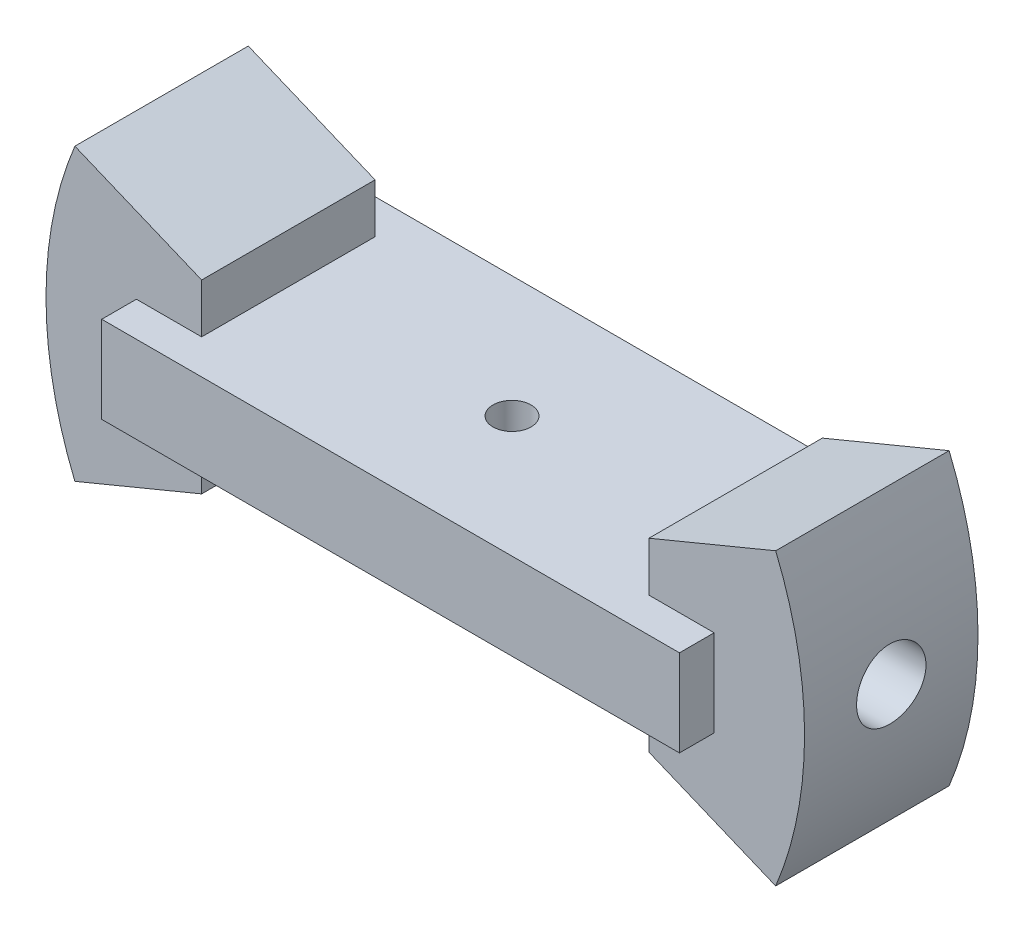
ISO-10303-21;
HEADER;
FILE_DESCRIPTION(('STEP AP214'),'2;1');
FILE_NAME('part.step','',(''),(''),'','','');
FILE_SCHEMA(('AUTOMOTIVE_DESIGN { 1 0 10303 214 1 1 1 1 }'));
ENDSEC;
DATA;
#1=APPLICATION_CONTEXT('core data for automotive mechanical design processes');
#2=APPLICATION_PROTOCOL_DEFINITION('international standard','automotive_design',2000,#1);
#3=PRODUCT_CONTEXT('',#1,'mechanical');
#4=PRODUCT('Part','Part','',(#3));
#5=PRODUCT_RELATED_PRODUCT_CATEGORY('part','',(#4));
#6=PRODUCT_DEFINITION_FORMATION('','',#4);
#7=PRODUCT_DEFINITION_CONTEXT('part definition',#1,'design');
#8=PRODUCT_DEFINITION('design','',#6,#7);
#9=PRODUCT_DEFINITION_SHAPE('','',#8);
#10=(LENGTH_UNIT() NAMED_UNIT(*) SI_UNIT(.MILLI.,.METRE.));
#11=(NAMED_UNIT(*) PLANE_ANGLE_UNIT() SI_UNIT($,.RADIAN.));
#12=(NAMED_UNIT(*) SI_UNIT($,.STERADIAN.) SOLID_ANGLE_UNIT());
#13=UNCERTAINTY_MEASURE_WITH_UNIT(LENGTH_MEASURE(1.E-05),#10,'distance_accuracy_value','');
#14=(GEOMETRIC_REPRESENTATION_CONTEXT(3) GLOBAL_UNCERTAINTY_ASSIGNED_CONTEXT((#13)) GLOBAL_UNIT_ASSIGNED_CONTEXT((#10,
#11,#12)) REPRESENTATION_CONTEXT('',''));
#15=CARTESIAN_POINT('',(0.,0.,0.));
#16=DIRECTION('',(0.,0.,1.));
#17=DIRECTION('',(1.,0.,0.));
#18=AXIS2_PLACEMENT_3D('',#15,#16,#17);
#19=CARTESIAN_POINT('',(0.,0.,5.));
#20=DIRECTION('',(0.,0.,-1.));
#21=DIRECTION('',(-1.,0.,0.));
#22=AXIS2_PLACEMENT_3D('',#19,#20,#21);
#23=CYLINDRICAL_SURFACE('',#22,21.8690409108858);
#24=CARTESIAN_POINT('',(0.,0.,-5.));
#25=DIRECTION('',(0.,0.,1.));
#26=DIRECTION('',(1.,0.,0.));
#27=AXIS2_PLACEMENT_3D('',#24,#25,#26);
#28=CIRCLE('',#27,21.8690409108858);
#29=CARTESIAN_POINT('',(-20.2043592932187,8.36891963831006,-5.));
#30=VERTEX_POINT('',#29);
#31=CARTESIAN_POINT('',(-20.20435929322,-8.36891963831054,-5.));
#32=VERTEX_POINT('',#31);
#33=EDGE_CURVE('E444',#30,#32,#28,.T.);
#34=ORIENTED_EDGE('',*,*,#33,.T.);
#35=DIRECTION('',(0.,0.,-1.));
#36=VECTOR('',#35,1.);
#37=CARTESIAN_POINT('',(-20.20435929322,-8.36891963831054,5.));
#38=LINE('',#37,#36);
#39=CARTESIAN_POINT('',(-20.20435929322,-8.36891963831054,5.));
#40=VERTEX_POINT('',#39);
#41=EDGE_CURVE('E427',#40,#32,#38,.T.);
#42=ORIENTED_EDGE('',*,*,#41,.F.);
#43=CARTESIAN_POINT('',(0.,0.,5.));
#44=DIRECTION('',(0.,0.,1.));
#45=DIRECTION('',(1.,0.,0.));
#46=AXIS2_PLACEMENT_3D('',#43,#44,#45);
#47=CIRCLE('',#46,21.8690409108858);
#48=CARTESIAN_POINT('',(-20.2043592932187,8.36891963831006,5.));
#49=VERTEX_POINT('',#48);
#50=EDGE_CURVE('E417',#49,#40,#47,.T.);
#51=ORIENTED_EDGE('',*,*,#50,.F.);
#52=DIRECTION('',(0.,0.,-1.));
#53=VECTOR('',#52,1.);
#54=CARTESIAN_POINT('',(-20.2043592932187,8.36891963831006,5.));
#55=LINE('',#54,#53);
#56=EDGE_CURVE('E340',#49,#30,#55,.T.);
#57=ORIENTED_EDGE('',*,*,#56,.T.);
#58=EDGE_LOOP('',(#34,#42,#51,#57));
#59=FACE_BOUND('',#58,.T.);
#60=CARTESIAN_POINT('',(-21.8690409108864,0.,2.));
#61=CARTESIAN_POINT('',(-21.8690397213227,0.112089664463375,1.99999512295925));
#62=CARTESIAN_POINT('',(-21.8681699652576,0.224254614490237,1.99054522016644));
#63=CARTESIAN_POINT('',(-21.8647839648554,0.44547822268207,1.952988470817));
#64=CARTESIAN_POINT('',(-21.8622658790731,0.554533264225593,1.92486075768378));
#65=CARTESIAN_POINT('',(-21.8558676315797,0.766301242493285,1.85077113856509));
#66=CARTESIAN_POINT('',(-21.8519882648713,0.869017839855905,1.80481964021593));
#67=CARTESIAN_POINT('',(-21.8433019153768,1.06525657356439,1.69640621555482));
#68=CARTESIAN_POINT('',(-21.838495124566,1.15878060671905,1.63394770517996));
#69=CARTESIAN_POINT('',(-21.8284765519697,1.33428701718916,1.49408904490956));
#70=CARTESIAN_POINT('',(-21.8232637129727,1.4162375890974,1.41664905501463));
#71=CARTESIAN_POINT('',(-21.8130293734237,1.56599767009884,1.24911028499715));
#72=CARTESIAN_POINT('',(-21.8080078814883,1.63380654298847,1.15901093566325));
#73=CARTESIAN_POINT('',(-21.7987137184883,1.75346858754936,0.96851514582595));
#74=CARTESIAN_POINT('',(-21.7944423847382,1.80529338610909,0.868100811600053));
#75=CARTESIAN_POINT('',(-21.7871447856867,1.89133496547931,0.659949851912011));
#76=CARTESIAN_POINT('',(-21.7841184943346,1.92555211470838,0.552213379710073));
#77=CARTESIAN_POINT('',(-21.7796628672773,1.97531380112811,0.332798036840375));
#78=CARTESIAN_POINT('',(-21.7782290591383,1.99091064209616,0.22113112058783));
#79=CARTESIAN_POINT('',(-21.7771067361357,2.00315060338177,-0.00324406866887942));
#80=CARTESIAN_POINT('',(-21.7774181824309,1.99979414550951,-0.115952318442186));
#81=CARTESIAN_POINT('',(-21.7797471038175,1.97426595735939,-0.338851387791299));
#82=CARTESIAN_POINT('',(-21.7817594135885,1.95215119310804,-0.449048793105066));
#83=CARTESIAN_POINT('',(-21.7872552408358,1.88982271479478,-0.664161201012784));
#84=CARTESIAN_POINT('',(-21.7907387752479,1.84960879238593,-0.769076142782637));
#85=CARTESIAN_POINT('',(-21.7987904929522,1.75216016106893,-0.9708262782836));
#86=CARTESIAN_POINT('',(-21.8033602944415,1.69490002622538,-1.06764912366689));
#87=CARTESIAN_POINT('',(-21.8130682139956,1.56500267582786,-1.25033154346086));
#88=CARTESIAN_POINT('',(-21.8182063459522,1.492365084365,-1.3361908497806));
#89=CARTESIAN_POINT('',(-21.8284949895234,1.33345585017337,-1.49484009553803));
#90=CARTESIAN_POINT('',(-21.8336454770451,1.24713498307862,-1.56758074062243));
#91=CARTESIAN_POINT('',(-21.8433605531265,1.06348088592331,-1.69754625628242));
#92=CARTESIAN_POINT('',(-21.8479251411813,0.96614764637026,-1.7547711134835));
#93=CARTESIAN_POINT('',(-21.8559552655945,0.763198714287586,-1.85207808838192));
#94=CARTESIAN_POINT('',(-21.8594206524982,0.657581897900834,-1.89215787517984));
#95=CARTESIAN_POINT('',(-21.8648603038929,0.441079240292039,-1.95400172934272));
#96=CARTESIAN_POINT('',(-21.8668346056634,0.330193530874918,-1.97576625462176));
#97=CARTESIAN_POINT('',(-21.8690648518853,0.106727821081886,-2.00029962696822));
#98=CARTESIAN_POINT('',(-21.8693269527913,-0.00584464868357277,-2.003136531694));
#99=CARTESIAN_POINT('',(-21.8681197389114,-0.229863515128783,-1.98991263673823));
#100=CARTESIAN_POINT('',(-21.8666504436318,-0.341309924480703,-1.97385204995986));
#101=CARTESIAN_POINT('',(-21.8621495652602,-0.559717955319533,-1.92334550666035));
#102=CARTESIAN_POINT('',(-21.8591206757226,-0.666686966362121,-1.88893124487516));
#103=CARTESIAN_POINT('',(-21.8518406487769,-0.873333013760587,-1.80272671068439));
#104=CARTESIAN_POINT('',(-21.8475894882551,-0.97300991217474,-1.75093610968162));
#105=CARTESIAN_POINT('',(-21.8383256438146,-1.16255106036906,-1.63127905678209));
#106=CARTESIAN_POINT('',(-21.8333108465726,-1.2523868509549,-1.56336769067338));
#107=CARTESIAN_POINT('',(-21.82308975625,-1.41940802548547,-1.41346151810693));
#108=CARTESIAN_POINT('',(-21.8178834591606,-1.49659314441653,-1.33146641668852));
#109=CARTESIAN_POINT('',(-21.8078477842621,-1.6363567524915,-1.15542422302215));
#110=CARTESIAN_POINT('',(-21.8030195845069,-1.69889071086053,-1.06134170031582));
#111=CARTESIAN_POINT('',(-21.7943040740356,-1.80727118991491,-0.863970930287627));
#112=CARTESIAN_POINT('',(-21.7904167522948,-1.85311790613708,-0.760682790852479));
#113=CARTESIAN_POINT('',(-21.7840301284849,-1.9267472311541,-0.547988127673196));
#114=CARTESIAN_POINT('',(-21.7815287599562,-1.95455674408282,-0.438590982038309));
#115=CARTESIAN_POINT('',(-21.7781905941658,-1.99140971051856,-0.216656100513207));
#116=CARTESIAN_POINT('',(-21.7773537576416,-2.00045360666376,-0.104118438764074));
#117=CARTESIAN_POINT('',(-21.7774401041594,-1.99951303187141,0.12046038430896));
#118=CARTESIAN_POINT('',(-21.7783568163985,-1.98959851975627,0.232501847727663));
#119=CARTESIAN_POINT('',(-21.7818331998998,-1.95116881805555,0.45332086204242));
#120=CARTESIAN_POINT('',(-21.7843928733849,-1.92265360330362,0.562098408522258));
#121=CARTESIAN_POINT('',(-21.7908650247273,-1.84785041643051,0.773303941777685));
#122=CARTESIAN_POINT('',(-21.7947773778146,-1.8015640834577,0.875732513149739));
#123=CARTESIAN_POINT('',(-21.8035143061078,-1.69254005232336,1.07137721367949));
#124=CARTESIAN_POINT('',(-21.8083388712927,-1.62980253487884,1.16459344401969));
#125=CARTESIAN_POINT('',(-21.8183778790036,-1.48939399641703,1.33952579412056));
#126=CARTESIAN_POINT('',(-21.8235936392946,-1.41167097606277,1.42120010169112));
#127=CARTESIAN_POINT('',(-21.8338152872476,-1.2435968562981,1.57038020615452));
#128=CARTESIAN_POINT('',(-21.8388211240689,-1.15324272050282,1.63788258647754));
#129=CARTESIAN_POINT('',(-21.8480697926132,-0.962262773789791,1.75691292783049));
#130=CARTESIAN_POINT('',(-21.8523109506547,-0.861615169460526,1.80840602283602));
#131=CARTESIAN_POINT('',(-21.8595335333265,-0.653130142938718,1.89369428456314));
#132=CARTESIAN_POINT('',(-21.8625163924084,-0.545301070894044,1.92750961439056));
#133=CARTESIAN_POINT('',(-21.8661280735963,-0.364039683630121,1.96795385440162));
#134=CARTESIAN_POINT('',(-21.8672153589118,-0.291769941063517,1.97995497967516));
#135=CARTESIAN_POINT('',(-21.8686721647263,-0.146344162643124,1.99597963147399));
#136=CARTESIAN_POINT('',(-21.8690416876033,-0.0731881297263421,2.00000318442822));
#137=CARTESIAN_POINT('',(-21.8690409108864,0.,2.));
#138=B_SPLINE_CURVE_WITH_KNOTS('',3,(#60,#61,#62,#63,#64,#65,#66,#67,#68,#69,#70,#71,#72,#73,
#74,#75,#76,#77,#78,#79,#80,#81,#82,#83,#84,#85,#86,#87,#88,#89,#90,#91,#92,#93,#94,#95,#96,#97,
#98,#99,#100,#101,#102,#103,#104,#105,#106,#107,#108,#109,#110,#111,#112,#113,#114,#115,#116,
#117,#118,#119,#120,#121,#122,#123,#124,#125,#126,#127,#128,#129,#130,#131,#132,#133,#134,#135,
#136,#137),.UNSPECIFIED.,.T.,.F.,(4,2,2,2,2,2,2,2,2,2,2,2,2,2,2,2,2,2,2,2,2,2,2,2,2,2,2,2,2,2,2,
2,2,2,2,2,2,2,4),(0.,0.336001758775393,0.672379526765314,1.0085611725551,1.3446733038024,
1.68169185372623,2.01872556209549,2.35635413618713,2.69397564552551,3.0306465398696,
3.36730994155235,3.70295459480914,4.03860311191025,4.3747548085841,4.7109147235875,
5.04831259871354,5.38571076467358,5.72315478588058,6.0605903701367,6.3968119872024,
6.73302981635988,7.06866890622881,7.40431434359568,7.74090613463186,8.07750497588888,
8.41511397594636,8.75271901986078,9.08981932988753,9.42691168839511,9.76276253535053,
10.0986138367058,10.4344341677021,10.7702508098513,11.107254410499,11.4443391629565,
11.7821529787751,12.1195806417562,12.3389712688624,12.5583611691468),.UNSPECIFIED.);
#139=CARTESIAN_POINT('',(-21.8690409108864,0.,2.));
#140=VERTEX_POINT('',#139);
#141=EDGE_CURVE('E11',#140,#140,#138,.T.);
#142=ORIENTED_EDGE('',*,*,#141,.F.);
#143=EDGE_LOOP('',(#142));
#144=FACE_BOUND('',#143,.T.);
#145=ADVANCED_FACE('F37',(#59,#144),#23,.T.);
#146=CARTESIAN_POINT('',(-16.6557635363631,0.,6.99999999999999));
#147=DIRECTION('',(-1.,0.,0.));
#148=DIRECTION('',(0.,0.,1.));
#149=AXIS2_PLACEMENT_3D('',#146,#147,#148);
#150=PLANE('',#149);
#151=DIRECTION('',(0.,0.,-1.));
#152=VECTOR('',#151,1.);
#153=CARTESIAN_POINT('',(-16.6557635363631,-2.5,6.99999999999999));
#154=LINE('',#153,#152);
#155=CARTESIAN_POINT('',(-16.6557635363631,-2.5,-5.));
#156=VERTEX_POINT('',#155);
#157=CARTESIAN_POINT('',(-16.6557635363631,-2.5,-6.99999999999999));
#158=VERTEX_POINT('',#157);
#159=EDGE_CURVE('E293',#156,#158,#154,.T.);
#160=ORIENTED_EDGE('',*,*,#159,.F.);
#161=DIRECTION('',(0.,1.,0.));
#162=VECTOR('',#161,1.);
#163=CARTESIAN_POINT('',(-16.6557635363631,0.,-5.));
#164=LINE('',#163,#162);
#165=CARTESIAN_POINT('',(-16.6557635363631,2.5,-5.));
#166=VERTEX_POINT('',#165);
#167=EDGE_CURVE('E295',#156,#166,#164,.T.);
#168=ORIENTED_EDGE('',*,*,#167,.T.);
#169=DIRECTION('',(0.,0.,-1.));
#170=VECTOR('',#169,1.);
#171=CARTESIAN_POINT('',(-16.6557635363631,2.5,6.99999999999999));
#172=LINE('',#171,#170);
#173=CARTESIAN_POINT('',(-16.6557635363631,2.5,-6.99999999999999));
#174=VERTEX_POINT('',#173);
#175=EDGE_CURVE('E309',#166,#174,#172,.T.);
#176=ORIENTED_EDGE('',*,*,#175,.T.);
#177=DIRECTION('',(0.,1.,0.));
#178=VECTOR('',#177,1.);
#179=CARTESIAN_POINT('',(-16.6557635363631,0.,-6.99999999999999));
#180=LINE('',#179,#178);
#181=EDGE_CURVE('E299',#158,#174,#180,.T.);
#182=ORIENTED_EDGE('',*,*,#181,.F.);
#183=EDGE_LOOP('',(#160,#168,#176,#182));
#184=FACE_BOUND('',#183,.T.);
#185=ADVANCED_FACE('F227',(#184),#150,.T.);
#186=CARTESIAN_POINT('',(0.,0.,5.));
#187=DIRECTION('',(-0.382683432365089,-0.923879532511287,0.));
#188=DIRECTION('',(0.923879532511287,-0.382683432365089,0.));
#189=AXIS2_PLACEMENT_3D('',#186,#187,#188);
#190=PLANE('',#189);
#191=DIRECTION('',(-0.923879532511287,0.38268343236509,0.));
#192=VECTOR('',#191,1.);
#193=CARTESIAN_POINT('',(0.,0.,-5.));
#194=LINE('',#193,#192);
#195=CARTESIAN_POINT('',(20.20435929322,-8.3689196383106,-5.));
#196=VERTEX_POINT('',#195);
#197=CARTESIAN_POINT('',(12.8948627796603,-5.34122704827534,-5.));
#198=VERTEX_POINT('',#197);
#199=EDGE_CURVE('E144',#196,#198,#194,.T.);
#200=ORIENTED_EDGE('',*,*,#199,.F.);
#201=DIRECTION('',(0.,0.,-1.));
#202=VECTOR('',#201,1.);
#203=CARTESIAN_POINT('',(20.20435929322,-8.3689196383106,5.));
#204=LINE('',#203,#202);
#205=CARTESIAN_POINT('',(20.20435929322,-8.3689196383106,5.));
#206=VERTEX_POINT('',#205);
#207=EDGE_CURVE('E100',#206,#196,#204,.T.);
#208=ORIENTED_EDGE('',*,*,#207,.F.);
#209=DIRECTION('',(-0.923879532511287,0.38268343236509,0.));
#210=VECTOR('',#209,1.);
#211=CARTESIAN_POINT('',(0.,0.,5.));
#212=LINE('',#211,#210);
#213=CARTESIAN_POINT('',(12.8948627796603,-5.34122704827534,5.));
#214=VERTEX_POINT('',#213);
#215=EDGE_CURVE('E155',#206,#214,#212,.T.);
#216=ORIENTED_EDGE('',*,*,#215,.T.);
#217=DIRECTION('',(0.,0.,-1.));
#218=VECTOR('',#217,1.);
#219=CARTESIAN_POINT('',(12.8948627796603,-5.34122704827534,5.));
#220=LINE('',#219,#218);
#221=EDGE_CURVE('E95',#214,#198,#220,.T.);
#222=ORIENTED_EDGE('',*,*,#221,.T.);
#223=EDGE_LOOP('',(#200,#208,#216,#222));
#224=FACE_BOUND('',#223,.T.);
#225=ADVANCED_FACE('F39',(#224),#190,.T.);
#226=CARTESIAN_POINT('',(0.,0.,5.));
#227=DIRECTION('',(0.,0.,-1.));
#228=DIRECTION('',(-1.,0.,0.));
#229=AXIS2_PLACEMENT_3D('',#226,#227,#228);
#230=CYLINDRICAL_SURFACE('',#229,21.8690409108864);
#231=CARTESIAN_POINT('',(21.8690409108864,0.,-2.));
#232=CARTESIAN_POINT('',(21.8690397213226,-0.11208966446338,-1.99999512295925));
#233=CARTESIAN_POINT('',(21.8681699652581,-0.224254614490246,-1.99054522016644));
#234=CARTESIAN_POINT('',(21.8647839648562,-0.445478222682081,-1.952988470817));
#235=CARTESIAN_POINT('',(21.8622658790738,-0.554533264225603,-1.92486075768378));
#236=CARTESIAN_POINT('',(21.8558676315802,-0.766301242493293,-1.85077113856509));
#237=CARTESIAN_POINT('',(21.8519882648719,-0.869017839855913,-1.80481964021593));
#238=CARTESIAN_POINT('',(21.8433019153775,-1.0652565735644,-1.69640621555482));
#239=CARTESIAN_POINT('',(21.8384951245667,-1.15878060671906,-1.63394770517995));
#240=CARTESIAN_POINT('',(21.8284765519704,-1.33428701718918,-1.49408904490955));
#241=CARTESIAN_POINT('',(21.8232637129733,-1.41623758909741,-1.41664905501462));
#242=CARTESIAN_POINT('',(21.8130293734243,-1.56599767009885,-1.24911028499714));
#243=CARTESIAN_POINT('',(21.808007881489,-1.63380654298848,-1.15901093566323));
#244=CARTESIAN_POINT('',(21.7987137184889,-1.75346858754936,-0.968515145825935));
#245=CARTESIAN_POINT('',(21.7944423847389,-1.8052933861091,-0.868100811600037));
#246=CARTESIAN_POINT('',(21.7871447856874,-1.89133496547932,-0.659949851911995));
#247=CARTESIAN_POINT('',(21.7841184943352,-1.92555211470838,-0.552213379710056));
#248=CARTESIAN_POINT('',(21.779662867278,-1.97531380112811,-0.332798036840358));
#249=CARTESIAN_POINT('',(21.778229059139,-1.99091064209616,-0.221131120587813));
#250=CARTESIAN_POINT('',(21.7771067361363,-2.00315060338177,0.00324406866889682));
#251=CARTESIAN_POINT('',(21.7774181824316,-1.99979414550951,0.115952318442203));
#252=CARTESIAN_POINT('',(21.7797471038181,-1.97426595735939,0.338851387791317));
#253=CARTESIAN_POINT('',(21.7817594135892,-1.95215119310803,0.449048793105083));
#254=CARTESIAN_POINT('',(21.7872552408365,-1.88982271479477,0.664161201012801));
#255=CARTESIAN_POINT('',(21.7907387752485,-1.84960879238592,0.769076142782654));
#256=CARTESIAN_POINT('',(21.7987904929528,-1.75216016106893,0.970826278283615));
#257=CARTESIAN_POINT('',(21.8033602944421,-1.69490002622537,1.0676491236669));
#258=CARTESIAN_POINT('',(21.8130682139963,-1.56500267582785,1.25033154346088));
#259=CARTESIAN_POINT('',(21.8182063459528,-1.49236508436499,1.33619084978061));
#260=CARTESIAN_POINT('',(21.828494989524,-1.33345585017335,1.49484009553805));
#261=CARTESIAN_POINT('',(21.8336454770457,-1.2471349830786,1.56758074062244));
#262=CARTESIAN_POINT('',(21.8433605531271,-1.0634808859233,1.69754625628243));
#263=CARTESIAN_POINT('',(21.8479251411819,-0.966147646370244,1.75477111348351));
#264=CARTESIAN_POINT('',(21.8559552655951,-0.763198714287569,1.85207808838193));
#265=CARTESIAN_POINT('',(21.8594206524989,-0.657581897900816,1.89215787517985));
#266=CARTESIAN_POINT('',(21.8648603038935,-0.44107924029202,1.95400172934273));
#267=CARTESIAN_POINT('',(21.866834605664,-0.330193530874899,1.97576625462177));
#268=CARTESIAN_POINT('',(21.8690648518859,-0.106727821081867,2.00029962696822));
#269=CARTESIAN_POINT('',(21.8693269527919,0.00584464868359205,2.003136531694));
#270=CARTESIAN_POINT('',(21.868119738912,0.229863515128802,1.98991263673823));
#271=CARTESIAN_POINT('',(21.8666504436325,0.341309924480722,1.97385204995985));
#272=CARTESIAN_POINT('',(21.8621495652608,0.55971795531955,1.92334550666035));
#273=CARTESIAN_POINT('',(21.8591206757233,0.666686966362138,1.88893124487515));
#274=CARTESIAN_POINT('',(21.8518406487776,0.873333013760604,1.80272671068438));
#275=CARTESIAN_POINT('',(21.8475894882558,0.973009912174756,1.75093610968161));
#276=CARTESIAN_POINT('',(21.8383256438152,1.16255106036907,1.63127905678208));
#277=CARTESIAN_POINT('',(21.8333108465732,1.25238685095491,1.56336769067337));
#278=CARTESIAN_POINT('',(21.8230897562506,1.41940802548549,1.41346151810691));
#279=CARTESIAN_POINT('',(21.8178834591612,1.49659314441655,1.33146641668851));
#280=CARTESIAN_POINT('',(21.8078477842627,1.63635675249151,1.15542422302214));
#281=CARTESIAN_POINT('',(21.8030195845075,1.69889071086054,1.0613417003158));
#282=CARTESIAN_POINT('',(21.7943040740363,1.80727118991492,0.86397093028761));
#283=CARTESIAN_POINT('',(21.7904167522954,1.85311790613709,0.760682790852462));
#284=CARTESIAN_POINT('',(21.7840301284855,1.9267472311541,0.547988127673177));
#285=CARTESIAN_POINT('',(21.7815287599568,1.95455674408282,0.43859098203829));
#286=CARTESIAN_POINT('',(21.7781905941664,1.99140971051856,0.216656100513188));
#287=CARTESIAN_POINT('',(21.7773537576422,2.00045360666376,0.104118438764055));
#288=CARTESIAN_POINT('',(21.77744010416,1.99951303187141,-0.12046038430898));
#289=CARTESIAN_POINT('',(21.7783568163991,1.98959851975627,-0.232501847727682));
#290=CARTESIAN_POINT('',(21.7818331999004,1.95116881805555,-0.453320862042439));
#291=CARTESIAN_POINT('',(21.7843928733855,1.92265360330362,-0.562098408522277));
#292=CARTESIAN_POINT('',(21.7908650247279,1.84785041643051,-0.773303941777702));
#293=CARTESIAN_POINT('',(21.7947773778153,1.80156408345769,-0.875732513149756));
#294=CARTESIAN_POINT('',(21.8035143061084,1.69254005232335,-1.07137721367951));
#295=CARTESIAN_POINT('',(21.8083388712933,1.62980253487883,-1.16459344401971));
#296=CARTESIAN_POINT('',(21.8183778790042,1.48939399641702,-1.33952579412058));
#297=CARTESIAN_POINT('',(21.8235936392953,1.41167097606275,-1.42120010169113));
#298=CARTESIAN_POINT('',(21.8338152872482,1.24359685629808,-1.57038020615453));
#299=CARTESIAN_POINT('',(21.8388211240695,1.15324272050281,-1.63788258647755));
#300=CARTESIAN_POINT('',(21.8480697926138,0.962262773789773,-1.7569129278305));
#301=CARTESIAN_POINT('',(21.8523109506553,0.861615169460507,-1.80840602283603));
#302=CARTESIAN_POINT('',(21.8595335333271,0.653130142938698,-1.89369428456315));
#303=CARTESIAN_POINT('',(21.862516392409,0.545301070894024,-1.92750961439056));
#304=CARTESIAN_POINT('',(21.8661280735969,0.364039683630107,-1.96795385440162));
#305=CARTESIAN_POINT('',(21.8672153589125,0.291769941063507,-1.97995497967516));
#306=CARTESIAN_POINT('',(21.8686721647268,0.146344162643121,-1.99597963147399));
#307=CARTESIAN_POINT('',(21.8690416876034,0.0731881297263405,-2.00000318442822));
#308=CARTESIAN_POINT('',(21.8690409108864,0.,-2.));
#309=B_SPLINE_CURVE_WITH_KNOTS('',3,(#231,#232,#233,#234,#235,#236,#237,#238,#239,#240,#241,
#242,#243,#244,#245,#246,#247,#248,#249,#250,#251,#252,#253,#254,#255,#256,#257,#258,#259,#260,
#261,#262,#263,#264,#265,#266,#267,#268,#269,#270,#271,#272,#273,#274,#275,#276,#277,#278,#279,
#280,#281,#282,#283,#284,#285,#286,#287,#288,#289,#290,#291,#292,#293,#294,#295,#296,#297,#298,
#299,#300,#301,#302,#303,#304,#305,#306,#307,#308),.UNSPECIFIED.,.T.,.F.,(4,2,2,2,2,2,2,2,2,2,2,
2,2,2,2,2,2,2,2,2,2,2,2,2,2,2,2,2,2,2,2,2,2,2,2,2,2,2,4),(0.,0.3360017587754,0.672379526765318,
1.00856117255511,1.34467330380241,1.68169185372625,2.0187255620955,2.35635413618714,
2.69397564552553,3.03064653986961,3.36730994155236,3.70295459480915,4.03860311191026,
4.37475480858412,4.71091472358751,5.04831259871356,5.38571076467359,5.72315478588059,
6.06059037013671,6.39681198720242,6.73302981635989,7.06866890622882,7.40431434359569,
7.74090613463187,8.07750497588889,8.41511397594637,8.75271901986079,9.08981932988754,
9.42691168839512,9.76276253535054,10.0986138367058,10.4344341677021,10.7702508098513,
11.107254410499,11.4443391629565,11.7821529787751,12.1195806417562,12.3389712688624,
12.5583611691468),.UNSPECIFIED.);
#310=CARTESIAN_POINT('',(21.8690409108864,0.,-2.));
#311=VERTEX_POINT('',#310);
#312=EDGE_CURVE('E49',#311,#311,#309,.T.);
#313=ORIENTED_EDGE('',*,*,#312,.T.);
#314=EDGE_LOOP('',(#313));
#315=FACE_BOUND('',#314,.T.);
#316=CARTESIAN_POINT('',(0.,0.,-5.));
#317=DIRECTION('',(0.,0.,1.));
#318=DIRECTION('',(1.,0.,0.));
#319=AXIS2_PLACEMENT_3D('',#316,#317,#318);
#320=CIRCLE('',#319,21.8690409108864);
#321=CARTESIAN_POINT('',(20.2043592932199,8.36891963831045,-5.));
#322=VERTEX_POINT('',#321);
#323=EDGE_CURVE('E148',#196,#322,#320,.T.);
#324=ORIENTED_EDGE('',*,*,#323,.T.);
#325=DIRECTION('',(0.,0.,-1.));
#326=VECTOR('',#325,1.);
#327=CARTESIAN_POINT('',(20.2043592932199,8.36891963831045,5.));
#328=LINE('',#327,#326);
#329=CARTESIAN_POINT('',(20.2043592932199,8.36891963831045,5.));
#330=VERTEX_POINT('',#329);
#331=EDGE_CURVE('E188',#330,#322,#328,.T.);
#332=ORIENTED_EDGE('',*,*,#331,.F.);
#333=CARTESIAN_POINT('',(0.,0.,5.));
#334=DIRECTION('',(0.,0.,1.));
#335=DIRECTION('',(1.,0.,0.));
#336=AXIS2_PLACEMENT_3D('',#333,#334,#335);
#337=CIRCLE('',#336,21.8690409108864);
#338=EDGE_CURVE('E157',#206,#330,#337,.T.);
#339=ORIENTED_EDGE('',*,*,#338,.F.);
#340=ORIENTED_EDGE('',*,*,#207,.T.);
#341=EDGE_LOOP('',(#324,#332,#339,#340));
#342=FACE_BOUND('',#341,.T.);
#343=ADVANCED_FACE('F194',(#315,#342),#230,.T.);
#344=CARTESIAN_POINT('',(0.,1.322207299068E-13,5.));
#345=DIRECTION('',(-0.38268343236508,0.923879532511291,0.));
#346=DIRECTION('',(-0.923879532511291,-0.38268343236508,0.));
#347=AXIS2_PLACEMENT_3D('',#344,#345,#346);
#348=PLANE('',#347);
#349=DIRECTION('',(0.923879532511291,0.38268343236508,0.));
#350=VECTOR('',#349,1.);
#351=CARTESIAN_POINT('',(0.,1.322207299068E-13,-5.));
#352=LINE('',#351,#350);
#353=CARTESIAN_POINT('',(12.8948627796603,5.34122704827533,-5.));
#354=VERTEX_POINT('',#353);
#355=EDGE_CURVE('E168',#354,#322,#352,.T.);
#356=ORIENTED_EDGE('',*,*,#355,.F.);
#357=DIRECTION('',(0.,0.,-1.));
#358=VECTOR('',#357,1.);
#359=CARTESIAN_POINT('',(12.8948627796603,5.34122704827533,5.));
#360=LINE('',#359,#358);
#361=CARTESIAN_POINT('',(12.8948627796603,5.34122704827533,5.));
#362=VERTEX_POINT('',#361);
#363=EDGE_CURVE('E186',#362,#354,#360,.T.);
#364=ORIENTED_EDGE('',*,*,#363,.F.);
#365=DIRECTION('',(0.923879532511291,0.38268343236508,0.));
#366=VECTOR('',#365,1.);
#367=CARTESIAN_POINT('',(0.,1.322207299068E-13,5.));
#368=LINE('',#367,#366);
#369=EDGE_CURVE('E160',#362,#330,#368,.T.);
#370=ORIENTED_EDGE('',*,*,#369,.T.);
#371=ORIENTED_EDGE('',*,*,#331,.T.);
#372=EDGE_LOOP('',(#356,#364,#370,#371));
#373=FACE_BOUND('',#372,.T.);
#374=ADVANCED_FACE('F264',(#373),#348,.T.);
#375=CARTESIAN_POINT('',(12.8948627796603,0.,5.));
#376=DIRECTION('',(1.,0.,0.));
#377=DIRECTION('',(0.,0.,-1.));
#378=AXIS2_PLACEMENT_3D('',#375,#376,#377);
#379=PLANE('',#378);
#380=DIRECTION('',(0.,-1.,0.));
#381=VECTOR('',#380,1.);
#382=CARTESIAN_POINT('',(12.8948627796603,0.,-5.));
#383=LINE('',#382,#381);
#384=CARTESIAN_POINT('',(12.8948627796603,2.5,-5.));
#385=VERTEX_POINT('',#384);
#386=EDGE_CURVE('E171',#354,#385,#383,.T.);
#387=ORIENTED_EDGE('',*,*,#386,.T.);
#388=DIRECTION('',(0.,0.,-1.));
#389=VECTOR('',#388,1.);
#390=CARTESIAN_POINT('',(12.8948627796603,2.5,5.));
#391=LINE('',#390,#389);
#392=CARTESIAN_POINT('',(12.8948627796603,2.5,5.));
#393=VERTEX_POINT('',#392);
#394=EDGE_CURVE('E183',#393,#385,#391,.T.);
#395=ORIENTED_EDGE('',*,*,#394,.F.);
#396=DIRECTION('',(0.,-1.,0.));
#397=VECTOR('',#396,1.);
#398=CARTESIAN_POINT('',(12.8948627796603,0.,5.));
#399=LINE('',#398,#397);
#400=EDGE_CURVE('E163',#362,#393,#399,.T.);
#401=ORIENTED_EDGE('',*,*,#400,.F.);
#402=ORIENTED_EDGE('',*,*,#363,.T.);
#403=EDGE_LOOP('',(#387,#395,#401,#402));
#404=FACE_BOUND('',#403,.T.);
#405=ADVANCED_FACE('F262',(#404),#379,.F.);
#406=CARTESIAN_POINT('',(12.8948627796603,-2.5,-5.));
#407=VERTEX_POINT('',#406);
#408=EDGE_CURVE('E158',#407,#198,#383,.T.);
#409=ORIENTED_EDGE('',*,*,#408,.T.);
#410=ORIENTED_EDGE('',*,*,#221,.F.);
#411=CARTESIAN_POINT('',(12.8948627796603,-2.5,5.));
#412=VERTEX_POINT('',#411);
#413=EDGE_CURVE('E65',#412,#214,#399,.T.);
#414=ORIENTED_EDGE('',*,*,#413,.F.);
#415=DIRECTION('',(0.,0.,-1.));
#416=VECTOR('',#415,1.);
#417=CARTESIAN_POINT('',(12.8948627796603,-2.5,5.));
#418=LINE('',#417,#416);
#419=EDGE_CURVE('E137',#412,#407,#418,.T.);
#420=ORIENTED_EDGE('',*,*,#419,.T.);
#421=EDGE_LOOP('',(#409,#410,#414,#420));
#422=FACE_BOUND('',#421,.T.);
#423=ADVANCED_FACE('F257',(#422),#379,.F.);
#424=CARTESIAN_POINT('',(0.,0.,5.));
#425=DIRECTION('',(0.,0.,1.));
#426=DIRECTION('',(1.,0.,0.));
#427=AXIS2_PLACEMENT_3D('',#424,#425,#426);
#428=PLANE('',#427);
#429=ORIENTED_EDGE('',*,*,#215,.F.);
#430=ORIENTED_EDGE('',*,*,#338,.T.);
#431=ORIENTED_EDGE('',*,*,#369,.F.);
#432=ORIENTED_EDGE('',*,*,#400,.T.);
#433=DIRECTION('',(1.,0.,0.));
#434=VECTOR('',#433,1.);
#435=CARTESIAN_POINT('',(0.,2.5,5.));
#436=LINE('',#435,#434);
#437=CARTESIAN_POINT('',(16.6557635363631,2.5,5.));
#438=VERTEX_POINT('',#437);
#439=EDGE_CURVE('E123',#393,#438,#436,.T.);
#440=ORIENTED_EDGE('',*,*,#439,.T.);
#441=DIRECTION('',(0.,1.,0.));
#442=VECTOR('',#441,1.);
#443=CARTESIAN_POINT('',(16.6557635363631,0.,5.));
#444=LINE('',#443,#442);
#445=CARTESIAN_POINT('',(16.6557635363631,-2.5,5.));
#446=VERTEX_POINT('',#445);
#447=EDGE_CURVE('E117',#446,#438,#444,.T.);
#448=ORIENTED_EDGE('',*,*,#447,.F.);
#449=DIRECTION('',(1.,0.,0.));
#450=VECTOR('',#449,1.);
#451=CARTESIAN_POINT('',(0.,-2.5,5.));
#452=LINE('',#451,#450);
#453=EDGE_CURVE('E120',#412,#446,#452,.T.);
#454=ORIENTED_EDGE('',*,*,#453,.F.);
#455=ORIENTED_EDGE('',*,*,#413,.T.);
#456=EDGE_LOOP('',(#429,#430,#431,#432,#440,#448,#454,#455));
#457=FACE_BOUND('',#456,.T.);
#458=ADVANCED_FACE('F119',(#457),#428,.T.);
#459=CARTESIAN_POINT('',(0.,0.,-5.));
#460=DIRECTION('',(0.,0.,1.));
#461=DIRECTION('',(1.,0.,0.));
#462=AXIS2_PLACEMENT_3D('',#459,#460,#461);
#463=PLANE('',#462);
#464=ORIENTED_EDGE('',*,*,#199,.T.);
#465=ORIENTED_EDGE('',*,*,#408,.F.);
#466=DIRECTION('',(1.,0.,0.));
#467=VECTOR('',#466,1.);
#468=CARTESIAN_POINT('',(0.,-2.5,-5.));
#469=LINE('',#468,#467);
#470=CARTESIAN_POINT('',(16.6557635363631,-2.5,-5.));
#471=VERTEX_POINT('',#470);
#472=EDGE_CURVE('E179',#407,#471,#469,.T.);
#473=ORIENTED_EDGE('',*,*,#472,.T.);
#474=DIRECTION('',(0.,1.,0.));
#475=VECTOR('',#474,1.);
#476=CARTESIAN_POINT('',(16.6557635363631,0.,-5.));
#477=LINE('',#476,#475);
#478=CARTESIAN_POINT('',(16.6557635363631,2.5,-5.));
#479=VERTEX_POINT('',#478);
#480=EDGE_CURVE('E176',#471,#479,#477,.T.);
#481=ORIENTED_EDGE('',*,*,#480,.T.);
#482=DIRECTION('',(1.,0.,0.));
#483=VECTOR('',#482,1.);
#484=CARTESIAN_POINT('',(0.,2.5,-5.));
#485=LINE('',#484,#483);
#486=EDGE_CURVE('E173',#385,#479,#485,.T.);
#487=ORIENTED_EDGE('',*,*,#486,.F.);
#488=ORIENTED_EDGE('',*,*,#386,.F.);
#489=ORIENTED_EDGE('',*,*,#355,.T.);
#490=ORIENTED_EDGE('',*,*,#323,.F.);
#491=EDGE_LOOP('',(#464,#465,#473,#481,#487,#488,#489,#490));
#492=FACE_BOUND('',#491,.T.);
#493=ADVANCED_FACE('F256',(#492),#463,.F.);
#494=CARTESIAN_POINT('',(16.6557635363631,0.,6.99999999999999));
#495=DIRECTION('',(-1.,0.,0.));
#496=DIRECTION('',(0.,0.,1.));
#497=AXIS2_PLACEMENT_3D('',#494,#495,#496);
#498=PLANE('',#497);
#499=DIRECTION('',(0.,0.,-1.));
#500=VECTOR('',#499,1.);
#501=CARTESIAN_POINT('',(16.6557635363631,2.5,6.99999999999999));
#502=LINE('',#501,#500);
#503=CARTESIAN_POINT('',(16.6557635363631,2.5,-6.99999999999999));
#504=VERTEX_POINT('',#503);
#505=EDGE_CURVE('E317',#479,#504,#502,.T.);
#506=ORIENTED_EDGE('',*,*,#505,.F.);
#507=ORIENTED_EDGE('',*,*,#480,.F.);
#508=DIRECTION('',(0.,0.,-1.));
#509=VECTOR('',#508,1.);
#510=CARTESIAN_POINT('',(16.6557635363631,-2.5,6.99999999999999));
#511=LINE('',#510,#509);
#512=CARTESIAN_POINT('',(16.6557635363631,-2.5,-6.99999999999999));
#513=VERTEX_POINT('',#512);
#514=EDGE_CURVE('E145',#471,#513,#511,.T.);
#515=ORIENTED_EDGE('',*,*,#514,.T.);
#516=DIRECTION('',(0.,1.,0.));
#517=VECTOR('',#516,1.);
#518=CARTESIAN_POINT('',(16.6557635363631,0.,-6.99999999999999));
#519=LINE('',#518,#517);
#520=EDGE_CURVE('E333',#513,#504,#519,.T.);
#521=ORIENTED_EDGE('',*,*,#520,.T.);
#522=EDGE_LOOP('',(#506,#507,#515,#521));
#523=FACE_BOUND('',#522,.T.);
#524=ADVANCED_FACE('F250',(#523),#498,.F.);
#525=CARTESIAN_POINT('',(0.,-2.5,6.99999999999999));
#526=DIRECTION('',(0.,1.,0.));
#527=DIRECTION('',(0.,0.,1.));
#528=AXIS2_PLACEMENT_3D('',#525,#526,#527);
#529=PLANE('',#528);
#530=CARTESIAN_POINT('',(0.,-2.5,0.));
#531=DIRECTION('',(0.,1.,0.));
#532=DIRECTION('',(0.,0.,1.));
#533=AXIS2_PLACEMENT_3D('',#530,#531,#532);
#534=CIRCLE('',#533,1.1);
#535=CARTESIAN_POINT('',(0.,-2.5,1.1));
#536=VERTEX_POINT('',#535);
#537=EDGE_CURVE('E445',#536,#536,#534,.F.);
#538=ORIENTED_EDGE('',*,*,#537,.F.);
#539=EDGE_LOOP('',(#538));
#540=FACE_BOUND('',#539,.T.);
#541=CARTESIAN_POINT('',(-16.6557635363631,-2.5,6.99999999999999));
#542=VERTEX_POINT('',#541);
#543=CARTESIAN_POINT('',(-16.6557635363631,-2.5,5.));
#544=VERTEX_POINT('',#543);
#545=EDGE_CURVE('E306',#542,#544,#154,.T.);
#546=ORIENTED_EDGE('',*,*,#545,.T.);
#547=DIRECTION('',(1.,0.,0.));
#548=VECTOR('',#547,1.);
#549=CARTESIAN_POINT('',(0.,-2.5,5.));
#550=LINE('',#549,#548);
#551=CARTESIAN_POINT('',(-12.8948627796603,-2.5,5.));
#552=VERTEX_POINT('',#551);
#553=EDGE_CURVE('E371',#544,#552,#550,.T.);
#554=ORIENTED_EDGE('',*,*,#553,.T.);
#555=DIRECTION('',(0.,0.,-1.));
#556=VECTOR('',#555,1.);
#557=CARTESIAN_POINT('',(-12.8948627796603,-2.5,5.));
#558=LINE('',#557,#556);
#559=CARTESIAN_POINT('',(-12.8948627796603,-2.5,-5.));
#560=VERTEX_POINT('',#559);
#561=EDGE_CURVE('E428',#552,#560,#558,.T.);
#562=ORIENTED_EDGE('',*,*,#561,.T.);
#563=DIRECTION('',(1.,0.,0.));
#564=VECTOR('',#563,1.);
#565=CARTESIAN_POINT('',(0.,-2.5,-5.));
#566=LINE('',#565,#564);
#567=EDGE_CURVE('E450',#156,#560,#566,.T.);
#568=ORIENTED_EDGE('',*,*,#567,.F.);
#569=ORIENTED_EDGE('',*,*,#159,.T.);
#570=DIRECTION('',(1.,0.,0.));
#571=VECTOR('',#570,1.);
#572=CARTESIAN_POINT('',(0.,-2.5,-6.99999999999999));
#573=LINE('',#572,#571);
#574=EDGE_CURVE('E334',#158,#513,#573,.T.);
#575=ORIENTED_EDGE('',*,*,#574,.T.);
#576=ORIENTED_EDGE('',*,*,#514,.F.);
#577=ORIENTED_EDGE('',*,*,#472,.F.);
#578=ORIENTED_EDGE('',*,*,#419,.F.);
#579=ORIENTED_EDGE('',*,*,#453,.T.);
#580=CARTESIAN_POINT('',(16.6557635363631,-2.5,6.99999999999999));
#581=VERTEX_POINT('',#580);
#582=EDGE_CURVE('E135',#581,#446,#511,.T.);
#583=ORIENTED_EDGE('',*,*,#582,.F.);
#584=DIRECTION('',(1.,0.,0.));
#585=VECTOR('',#584,1.);
#586=CARTESIAN_POINT('',(0.,-2.5,6.99999999999999));
#587=LINE('',#586,#585);
#588=EDGE_CURVE('E335',#542,#581,#587,.T.);
#589=ORIENTED_EDGE('',*,*,#588,.F.);
#590=EDGE_LOOP('',(#546,#554,#562,#568,#569,#575,#576,#577,#578,#579,#583,#589));
#591=FACE_BOUND('',#590,.T.);
#592=ADVANCED_FACE('F132',(#540,#591),#529,.F.);
#593=ORIENTED_EDGE('',*,*,#447,.T.);
#594=CARTESIAN_POINT('',(16.6557635363631,2.5,6.99999999999999));
#595=VERTEX_POINT('',#594);
#596=EDGE_CURVE('E151',#595,#438,#502,.T.);
#597=ORIENTED_EDGE('',*,*,#596,.F.);
#598=DIRECTION('',(0.,1.,0.));
#599=VECTOR('',#598,1.);
#600=CARTESIAN_POINT('',(16.6557635363631,0.,6.99999999999999));
#601=LINE('',#600,#599);
#602=EDGE_CURVE('E142',#581,#595,#601,.T.);
#603=ORIENTED_EDGE('',*,*,#602,.F.);
#604=ORIENTED_EDGE('',*,*,#582,.T.);
#605=EDGE_LOOP('',(#593,#597,#603,#604));
#606=FACE_BOUND('',#605,.T.);
#607=ADVANCED_FACE('F140',(#606),#498,.F.);
#608=CARTESIAN_POINT('',(0.,2.5,6.99999999999999));
#609=DIRECTION('',(0.,1.,0.));
#610=DIRECTION('',(0.,0.,1.));
#611=AXIS2_PLACEMENT_3D('',#608,#609,#610);
#612=PLANE('',#611);
#613=CARTESIAN_POINT('',(0.,2.5,0.));
#614=DIRECTION('',(0.,1.,0.));
#615=DIRECTION('',(0.,0.,1.));
#616=AXIS2_PLACEMENT_3D('',#613,#614,#615);
#617=CIRCLE('',#616,1.1);
#618=CARTESIAN_POINT('',(0.,2.5,1.1));
#619=VERTEX_POINT('',#618);
#620=EDGE_CURVE('E466',#619,#619,#617,.T.);
#621=ORIENTED_EDGE('',*,*,#620,.F.);
#622=EDGE_LOOP('',(#621));
#623=FACE_BOUND('',#622,.T.);
#624=DIRECTION('',(1.,0.,0.));
#625=VECTOR('',#624,1.);
#626=CARTESIAN_POINT('',(0.,2.5,5.));
#627=LINE('',#626,#625);
#628=CARTESIAN_POINT('',(-16.6557635363631,2.5,5.));
#629=VERTEX_POINT('',#628);
#630=CARTESIAN_POINT('',(-12.8948627796603,2.5,5.));
#631=VERTEX_POINT('',#630);
#632=EDGE_CURVE('E434',#629,#631,#627,.T.);
#633=ORIENTED_EDGE('',*,*,#632,.F.);
#634=CARTESIAN_POINT('',(-16.6557635363631,2.5,6.99999999999999));
#635=VERTEX_POINT('',#634);
#636=EDGE_CURVE('E315',#635,#629,#172,.T.);
#637=ORIENTED_EDGE('',*,*,#636,.F.);
#638=DIRECTION('',(1.,0.,0.));
#639=VECTOR('',#638,1.);
#640=CARTESIAN_POINT('',(0.,2.5,6.99999999999999));
#641=LINE('',#640,#639);
#642=EDGE_CURVE('E311',#635,#595,#641,.T.);
#643=ORIENTED_EDGE('',*,*,#642,.T.);
#644=ORIENTED_EDGE('',*,*,#596,.T.);
#645=ORIENTED_EDGE('',*,*,#439,.F.);
#646=ORIENTED_EDGE('',*,*,#394,.T.);
#647=ORIENTED_EDGE('',*,*,#486,.T.);
#648=ORIENTED_EDGE('',*,*,#505,.T.);
#649=DIRECTION('',(1.,0.,0.));
#650=VECTOR('',#649,1.);
#651=CARTESIAN_POINT('',(0.,2.5,-6.99999999999999));
#652=LINE('',#651,#650);
#653=EDGE_CURVE('E328',#174,#504,#652,.T.);
#654=ORIENTED_EDGE('',*,*,#653,.F.);
#655=ORIENTED_EDGE('',*,*,#175,.F.);
#656=DIRECTION('',(1.,0.,0.));
#657=VECTOR('',#656,1.);
#658=CARTESIAN_POINT('',(0.,2.5,-5.));
#659=LINE('',#658,#657);
#660=CARTESIAN_POINT('',(-12.8948627796603,2.5,-5.));
#661=VERTEX_POINT('',#660);
#662=EDGE_CURVE('E56',#166,#661,#659,.T.);
#663=ORIENTED_EDGE('',*,*,#662,.T.);
#664=DIRECTION('',(0.,0.,-1.));
#665=VECTOR('',#664,1.);
#666=CARTESIAN_POINT('',(-12.8948627796603,2.5,5.));
#667=LINE('',#666,#665);
#668=EDGE_CURVE('E437',#631,#661,#667,.T.);
#669=ORIENTED_EDGE('',*,*,#668,.F.);
#670=EDGE_LOOP('',(#633,#637,#643,#644,#645,#646,#647,#648,#654,#655,#663,#669));
#671=FACE_BOUND('',#670,.T.);
#672=ADVANCED_FACE('F243',(#623,#671),#612,.T.);
#673=DIRECTION('',(0.,1.,0.));
#674=VECTOR('',#673,1.);
#675=CARTESIAN_POINT('',(-16.6557635363631,0.,5.));
#676=LINE('',#675,#674);
#677=EDGE_CURVE('E366',#544,#629,#676,.T.);
#678=ORIENTED_EDGE('',*,*,#677,.F.);
#679=ORIENTED_EDGE('',*,*,#545,.F.);
#680=DIRECTION('',(0.,1.,0.));
#681=VECTOR('',#680,1.);
#682=CARTESIAN_POINT('',(-16.6557635363631,0.,6.99999999999999));
#683=LINE('',#682,#681);
#684=EDGE_CURVE('E307',#542,#635,#683,.T.);
#685=ORIENTED_EDGE('',*,*,#684,.T.);
#686=ORIENTED_EDGE('',*,*,#636,.T.);
#687=EDGE_LOOP('',(#678,#679,#685,#686));
#688=FACE_BOUND('',#687,.T.);
#689=ADVANCED_FACE('F236',(#688),#150,.T.);
#690=CARTESIAN_POINT('',(0.,0.,6.99999999999999));
#691=DIRECTION('',(0.,0.,1.));
#692=DIRECTION('',(1.,0.,0.));
#693=AXIS2_PLACEMENT_3D('',#690,#691,#692);
#694=PLANE('',#693);
#695=ORIENTED_EDGE('',*,*,#588,.T.);
#696=ORIENTED_EDGE('',*,*,#602,.T.);
#697=ORIENTED_EDGE('',*,*,#642,.F.);
#698=ORIENTED_EDGE('',*,*,#684,.F.);
#699=EDGE_LOOP('',(#695,#696,#697,#698));
#700=FACE_BOUND('',#699,.T.);
#701=ADVANCED_FACE('F233',(#700),#694,.T.);
#702=CARTESIAN_POINT('',(0.,0.,-6.99999999999999));
#703=DIRECTION('',(0.,0.,1.));
#704=DIRECTION('',(1.,0.,0.));
#705=AXIS2_PLACEMENT_3D('',#702,#703,#704);
#706=PLANE('',#705);
#707=ORIENTED_EDGE('',*,*,#574,.F.);
#708=ORIENTED_EDGE('',*,*,#181,.T.);
#709=ORIENTED_EDGE('',*,*,#653,.T.);
#710=ORIENTED_EDGE('',*,*,#520,.F.);
#711=EDGE_LOOP('',(#707,#708,#709,#710));
#712=FACE_BOUND('',#711,.T.);
#713=ADVANCED_FACE('F231',(#712),#706,.F.);
#714=CARTESIAN_POINT('',(0.,0.,5.));
#715=DIRECTION('',(0.38268343236509,0.923879532511287,0.));
#716=DIRECTION('',(-0.923879532511287,0.38268343236509,0.));
#717=AXIS2_PLACEMENT_3D('',#714,#715,#716);
#718=PLANE('',#717);
#719=DIRECTION('',(0.923879532511287,-0.38268343236509,0.));
#720=VECTOR('',#719,1.);
#721=CARTESIAN_POINT('',(0.,0.,-5.));
#722=LINE('',#721,#720);
#723=CARTESIAN_POINT('',(-12.8948627796603,5.34122704827533,-5.));
#724=VERTEX_POINT('',#723);
#725=EDGE_CURVE('E442',#30,#724,#722,.T.);
#726=ORIENTED_EDGE('',*,*,#725,.F.);
#727=ORIENTED_EDGE('',*,*,#56,.F.);
#728=DIRECTION('',(0.923879532511287,-0.38268343236509,0.));
#729=VECTOR('',#728,1.);
#730=CARTESIAN_POINT('',(0.,0.,5.));
#731=LINE('',#730,#729);
#732=CARTESIAN_POINT('',(-12.8948627796603,5.34122704827533,5.));
#733=VERTEX_POINT('',#732);
#734=EDGE_CURVE('E460',#49,#733,#731,.T.);
#735=ORIENTED_EDGE('',*,*,#734,.T.);
#736=DIRECTION('',(0.,0.,-1.));
#737=VECTOR('',#736,1.);
#738=CARTESIAN_POINT('',(-12.8948627796603,5.34122704827533,5.));
#739=LINE('',#738,#737);
#740=EDGE_CURVE('E402',#733,#724,#739,.T.);
#741=ORIENTED_EDGE('',*,*,#740,.T.);
#742=EDGE_LOOP('',(#726,#727,#735,#741));
#743=FACE_BOUND('',#742,.T.);
#744=ADVANCED_FACE('F222',(#743),#718,.T.);
#745=CARTESIAN_POINT('',(0.,0.,5.));
#746=DIRECTION('',(-0.382683432365083,0.92387953251129,0.));
#747=DIRECTION('',(-0.92387953251129,-0.382683432365083,0.));
#748=AXIS2_PLACEMENT_3D('',#745,#746,#747);
#749=PLANE('',#748);
#750=DIRECTION('',(0.92387953251129,0.382683432365083,0.));
#751=VECTOR('',#750,1.);
#752=CARTESIAN_POINT('',(0.,0.,-5.));
#753=LINE('',#752,#751);
#754=CARTESIAN_POINT('',(-12.8948627796603,-5.34122704827534,-5.));
#755=VERTEX_POINT('',#754);
#756=EDGE_CURVE('E424',#32,#755,#753,.T.);
#757=ORIENTED_EDGE('',*,*,#756,.T.);
#758=DIRECTION('',(0.,0.,-1.));
#759=VECTOR('',#758,1.);
#760=CARTESIAN_POINT('',(-12.8948627796603,-5.34122704827534,5.));
#761=LINE('',#760,#759);
#762=CARTESIAN_POINT('',(-12.8948627796603,-5.34122704827534,5.));
#763=VERTEX_POINT('',#762);
#764=EDGE_CURVE('E422',#763,#755,#761,.T.);
#765=ORIENTED_EDGE('',*,*,#764,.F.);
#766=DIRECTION('',(0.92387953251129,0.382683432365083,0.));
#767=VECTOR('',#766,1.);
#768=CARTESIAN_POINT('',(0.,0.,5.));
#769=LINE('',#768,#767);
#770=EDGE_CURVE('E412',#40,#763,#769,.T.);
#771=ORIENTED_EDGE('',*,*,#770,.F.);
#772=ORIENTED_EDGE('',*,*,#41,.T.);
#773=EDGE_LOOP('',(#757,#765,#771,#772));
#774=FACE_BOUND('',#773,.T.);
#775=ADVANCED_FACE('F220',(#774),#749,.F.);
#776=CARTESIAN_POINT('',(-12.8948627796603,0.,5.));
#777=DIRECTION('',(1.,0.,0.));
#778=DIRECTION('',(0.,0.,-1.));
#779=AXIS2_PLACEMENT_3D('',#776,#777,#778);
#780=PLANE('',#779);
#781=DIRECTION('',(0.,-1.,0.));
#782=VECTOR('',#781,1.);
#783=CARTESIAN_POINT('',(-12.8948627796603,0.,-5.));
#784=LINE('',#783,#782);
#785=EDGE_CURVE('E448',#560,#755,#784,.T.);
#786=ORIENTED_EDGE('',*,*,#785,.F.);
#787=ORIENTED_EDGE('',*,*,#561,.F.);
#788=DIRECTION('',(0.,-1.,0.));
#789=VECTOR('',#788,1.);
#790=CARTESIAN_POINT('',(-12.8948627796603,0.,5.));
#791=LINE('',#790,#789);
#792=EDGE_CURVE('E416',#552,#763,#791,.T.);
#793=ORIENTED_EDGE('',*,*,#792,.T.);
#794=ORIENTED_EDGE('',*,*,#764,.T.);
#795=EDGE_LOOP('',(#786,#787,#793,#794));
#796=FACE_BOUND('',#795,.T.);
#797=ADVANCED_FACE('F218',(#796),#780,.T.);
#798=EDGE_CURVE('E451',#724,#661,#784,.T.);
#799=ORIENTED_EDGE('',*,*,#798,.F.);
#800=ORIENTED_EDGE('',*,*,#740,.F.);
#801=EDGE_CURVE('E431',#733,#631,#791,.T.);
#802=ORIENTED_EDGE('',*,*,#801,.T.);
#803=ORIENTED_EDGE('',*,*,#668,.T.);
#804=EDGE_LOOP('',(#799,#800,#802,#803));
#805=FACE_BOUND('',#804,.T.);
#806=ADVANCED_FACE('F212',(#805),#780,.T.);
#807=CARTESIAN_POINT('',(0.,0.,5.));
#808=DIRECTION('',(0.,0.,1.));
#809=DIRECTION('',(1.,0.,0.));
#810=AXIS2_PLACEMENT_3D('',#807,#808,#809);
#811=PLANE('',#810);
#812=ORIENTED_EDGE('',*,*,#734,.F.);
#813=ORIENTED_EDGE('',*,*,#50,.T.);
#814=ORIENTED_EDGE('',*,*,#770,.T.);
#815=ORIENTED_EDGE('',*,*,#792,.F.);
#816=ORIENTED_EDGE('',*,*,#553,.F.);
#817=ORIENTED_EDGE('',*,*,#677,.T.);
#818=ORIENTED_EDGE('',*,*,#632,.T.);
#819=ORIENTED_EDGE('',*,*,#801,.F.);
#820=EDGE_LOOP('',(#812,#813,#814,#815,#816,#817,#818,#819));
#821=FACE_BOUND('',#820,.T.);
#822=ADVANCED_FACE('F209',(#821),#811,.T.);
#823=CARTESIAN_POINT('',(0.,0.,-5.));
#824=DIRECTION('',(0.,0.,1.));
#825=DIRECTION('',(1.,0.,0.));
#826=AXIS2_PLACEMENT_3D('',#823,#824,#825);
#827=PLANE('',#826);
#828=ORIENTED_EDGE('',*,*,#725,.T.);
#829=ORIENTED_EDGE('',*,*,#798,.T.);
#830=ORIENTED_EDGE('',*,*,#662,.F.);
#831=ORIENTED_EDGE('',*,*,#167,.F.);
#832=ORIENTED_EDGE('',*,*,#567,.T.);
#833=ORIENTED_EDGE('',*,*,#785,.T.);
#834=ORIENTED_EDGE('',*,*,#756,.F.);
#835=ORIENTED_EDGE('',*,*,#33,.F.);
#836=EDGE_LOOP('',(#828,#829,#830,#831,#832,#833,#834,#835));
#837=FACE_BOUND('',#836,.T.);
#838=ADVANCED_FACE('F207',(#837),#827,.F.);
#839=CARTESIAN_POINT('',(0.,-8.3699196383106,0.));
#840=DIRECTION('',(0.,1.,0.));
#841=DIRECTION('',(0.,0.,1.));
#842=AXIS2_PLACEMENT_3D('',#839,#840,#841);
#843=CYLINDRICAL_SURFACE('',#842,1.1);
#844=ORIENTED_EDGE('',*,*,#620,.T.);
#845=EDGE_LOOP('',(#844));
#846=FACE_BOUND('',#845,.T.);
#847=ORIENTED_EDGE('',*,*,#537,.T.);
#848=EDGE_LOOP('',(#847));
#849=FACE_BOUND('',#848,.T.);
#850=ADVANCED_FACE('F203',(#846,#849),#843,.F.);
#851=CARTESIAN_POINT('',(17.8690409108864,0.,0.));
#852=DIRECTION('',(1.,0.,0.));
#853=DIRECTION('',(0.,0.,-1.));
#854=AXIS2_PLACEMENT_3D('',#851,#852,#853);
#855=CYLINDRICAL_SURFACE('',#854,2.);
#856=CARTESIAN_POINT('',(17.8690409108864,0.,0.));
#857=DIRECTION('',(1.,0.,0.));
#858=DIRECTION('',(0.,0.,-1.));
#859=AXIS2_PLACEMENT_3D('',#856,#857,#858);
#860=CIRCLE('',#859,2.);
#861=CARTESIAN_POINT('',(17.8690409108864,0.,-2.));
#862=VERTEX_POINT('',#861);
#863=EDGE_CURVE('E469',#862,#862,#860,.T.);
#864=ORIENTED_EDGE('',*,*,#863,.F.);
#865=EDGE_LOOP('',(#864));
#866=FACE_BOUND('',#865,.T.);
#867=ORIENTED_EDGE('',*,*,#312,.F.);
#868=EDGE_LOOP('',(#867));
#869=FACE_BOUND('',#868,.T.);
#870=ADVANCED_FACE('F197',(#866,#869),#855,.F.);
#871=CARTESIAN_POINT('',(17.8690409108864,0.,0.));
#872=DIRECTION('',(1.,0.,0.));
#873=DIRECTION('',(0.,0.,-1.));
#874=AXIS2_PLACEMENT_3D('',#871,#872,#873);
#875=PLANE('',#874);
#876=ORIENTED_EDGE('',*,*,#863,.T.);
#877=EDGE_LOOP('',(#876));
#878=FACE_BOUND('',#877,.T.);
#879=ADVANCED_FACE('F202',(#878),#875,.T.);
#880=CARTESIAN_POINT('',(-17.8690409108864,0.,0.));
#881=DIRECTION('',(-1.,0.,0.));
#882=DIRECTION('',(0.,0.,1.));
#883=AXIS2_PLACEMENT_3D('',#880,#881,#882);
#884=CYLINDRICAL_SURFACE('',#883,2.);
#885=CARTESIAN_POINT('',(-17.8690409108864,0.,0.));
#886=DIRECTION('',(1.,0.,0.));
#887=DIRECTION('',(0.,0.,-1.));
#888=AXIS2_PLACEMENT_3D('',#885,#886,#887);
#889=CIRCLE('',#888,2.);
#890=CARTESIAN_POINT('',(-17.8690409108864,0.,-2.));
#891=VERTEX_POINT('',#890);
#892=EDGE_CURVE('E472',#891,#891,#889,.T.);
#893=ORIENTED_EDGE('',*,*,#892,.T.);
#894=EDGE_LOOP('',(#893));
#895=FACE_BOUND('',#894,.T.);
#896=ORIENTED_EDGE('',*,*,#141,.T.);
#897=EDGE_LOOP('',(#896));
#898=FACE_BOUND('',#897,.T.);
#899=ADVANCED_FACE('F476',(#895,#898),#884,.F.);
#900=CARTESIAN_POINT('',(-17.8690409108864,0.,0.));
#901=DIRECTION('',(-1.,0.,0.));
#902=DIRECTION('',(0.,0.,-1.));
#903=AXIS2_PLACEMENT_3D('',#900,#901,#902);
#904=PLANE('',#903);
#905=ORIENTED_EDGE('',*,*,#892,.F.);
#906=EDGE_LOOP('',(#905));
#907=FACE_BOUND('',#906,.T.);
#908=ADVANCED_FACE('F479',(#907),#904,.T.);
#909=CLOSED_SHELL('',(#145,#185,#225,#343,#374,#405,#423,#458,#493,#524,#592,#607,#672,#689,
#701,#713,#744,#775,#797,#806,#822,#838,#850,#870,#879,#899,#908));
#910=MANIFOLD_SOLID_BREP('B2',#909);
#911=ADVANCED_BREP_SHAPE_REPRESENTATION('',(#18,#910),#14);
#912=SHAPE_DEFINITION_REPRESENTATION(#9,#911);
ENDSEC;
END-ISO-10303-21;
